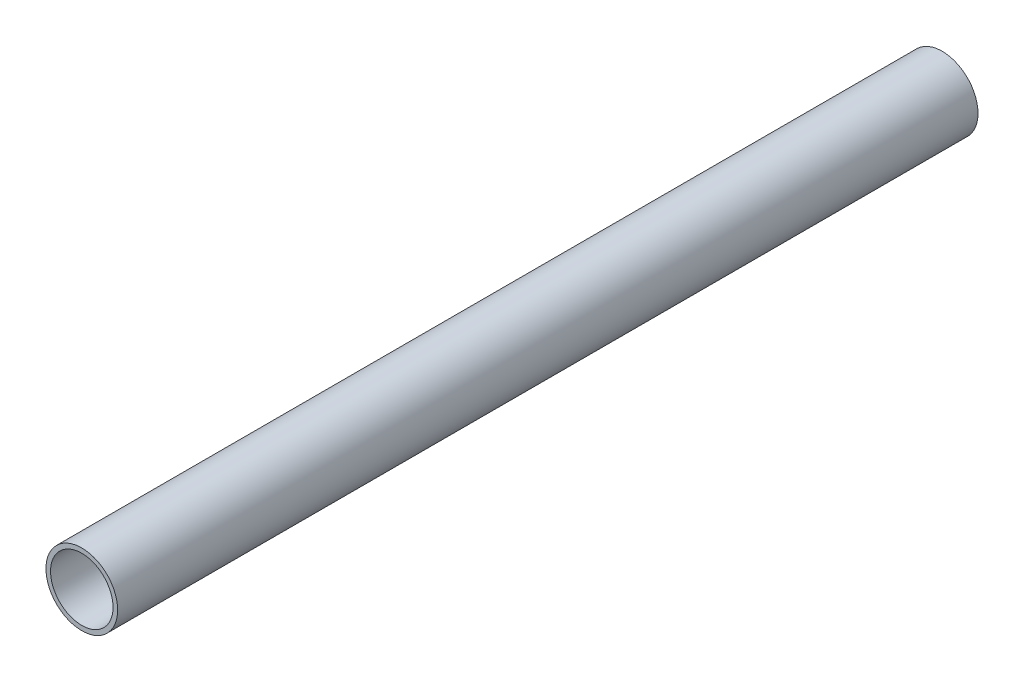
ISO-10303-21;
HEADER;
FILE_DESCRIPTION(('STEP AP214'),'2;1');
FILE_NAME('part.step','',(''),(''),'','','');
FILE_SCHEMA(('AUTOMOTIVE_DESIGN { 1 0 10303 214 1 1 1 1 }'));
ENDSEC;
DATA;
#1=APPLICATION_CONTEXT('core data for automotive mechanical design processes');
#2=APPLICATION_PROTOCOL_DEFINITION('international standard','automotive_design',2000,#1);
#3=PRODUCT_CONTEXT('',#1,'mechanical');
#4=PRODUCT('Part','Part','',(#3));
#5=PRODUCT_RELATED_PRODUCT_CATEGORY('part','',(#4));
#6=PRODUCT_DEFINITION_FORMATION('','',#4);
#7=PRODUCT_DEFINITION_CONTEXT('part definition',#1,'design');
#8=PRODUCT_DEFINITION('design','',#6,#7);
#9=PRODUCT_DEFINITION_SHAPE('','',#8);
#10=(LENGTH_UNIT() NAMED_UNIT(*) SI_UNIT(.MILLI.,.METRE.));
#11=(NAMED_UNIT(*) PLANE_ANGLE_UNIT() SI_UNIT($,.RADIAN.));
#12=(NAMED_UNIT(*) SI_UNIT($,.STERADIAN.) SOLID_ANGLE_UNIT());
#13=UNCERTAINTY_MEASURE_WITH_UNIT(LENGTH_MEASURE(1.E-05),#10,'distance_accuracy_value','');
#14=(GEOMETRIC_REPRESENTATION_CONTEXT(3) GLOBAL_UNCERTAINTY_ASSIGNED_CONTEXT((#13)) GLOBAL_UNIT_ASSIGNED_CONTEXT((#10,
#11,#12)) REPRESENTATION_CONTEXT('',''));
#15=CARTESIAN_POINT('',(0.,0.,0.));
#16=DIRECTION('',(0.,0.,1.));
#17=DIRECTION('',(1.,0.,0.));
#18=AXIS2_PLACEMENT_3D('',#15,#16,#17);
#19=CARTESIAN_POINT('',(0.,0.,76.2));
#20=DIRECTION('',(0.,0.,1.));
#21=DIRECTION('',(1.,0.,0.));
#22=AXIS2_PLACEMENT_3D('',#19,#20,#21);
#23=PLANE('',#22);
#24=CARTESIAN_POINT('',(0.,0.,76.2));
#25=DIRECTION('',(0.,0.,1.));
#26=DIRECTION('',(1.,0.,0.));
#27=AXIS2_PLACEMENT_3D('',#24,#25,#26);
#28=CIRCLE('',#27,6.35);
#29=CARTESIAN_POINT('',(6.35,0.,76.2));
#30=VERTEX_POINT('',#29);
#31=EDGE_CURVE('E10',#30,#30,#28,.T.);
#32=ORIENTED_EDGE('',*,*,#31,.T.);
#33=EDGE_LOOP('',(#32));
#34=FACE_BOUND('',#33,.T.);
#35=CARTESIAN_POINT('',(0.,0.,76.2));
#36=DIRECTION('',(0.,0.,1.));
#37=DIRECTION('',(1.,0.,0.));
#38=AXIS2_PLACEMENT_3D('',#35,#36,#37);
#39=CIRCLE('',#38,5.5372);
#40=CARTESIAN_POINT('',(5.5372,0.,76.2));
#41=VERTEX_POINT('',#40);
#42=EDGE_CURVE('E42',#41,#41,#39,.T.);
#43=ORIENTED_EDGE('',*,*,#42,.F.);
#44=EDGE_LOOP('',(#43));
#45=FACE_BOUND('',#44,.T.);
#46=ADVANCED_FACE('F31',(#34,#45),#23,.T.);
#47=CARTESIAN_POINT('',(0.,0.,-76.2));
#48=DIRECTION('',(0.,0.,1.));
#49=DIRECTION('',(1.,0.,0.));
#50=AXIS2_PLACEMENT_3D('',#47,#48,#49);
#51=PLANE('',#50);
#52=CARTESIAN_POINT('',(0.,0.,-76.2));
#53=DIRECTION('',(0.,0.,1.));
#54=DIRECTION('',(1.,0.,0.));
#55=AXIS2_PLACEMENT_3D('',#52,#53,#54);
#56=CIRCLE('',#55,6.35);
#57=CARTESIAN_POINT('',(6.35,0.,-76.2));
#58=VERTEX_POINT('',#57);
#59=EDGE_CURVE('E35',#58,#58,#56,.T.);
#60=ORIENTED_EDGE('',*,*,#59,.F.);
#61=EDGE_LOOP('',(#60));
#62=FACE_BOUND('',#61,.T.);
#63=CARTESIAN_POINT('',(0.,0.,-76.2));
#64=DIRECTION('',(0.,0.,1.));
#65=DIRECTION('',(1.,0.,0.));
#66=AXIS2_PLACEMENT_3D('',#63,#64,#65);
#67=CIRCLE('',#66,5.5372);
#68=CARTESIAN_POINT('',(5.5372,0.,-76.2));
#69=VERTEX_POINT('',#68);
#70=EDGE_CURVE('E44',#69,#69,#67,.T.);
#71=ORIENTED_EDGE('',*,*,#70,.T.);
#72=EDGE_LOOP('',(#71));
#73=FACE_BOUND('',#72,.T.);
#74=ADVANCED_FACE('F54',(#62,#73),#51,.F.);
#75=CARTESIAN_POINT('',(0.,0.,76.2));
#76=DIRECTION('',(0.,0.,-1.));
#77=DIRECTION('',(-1.,0.,0.));
#78=AXIS2_PLACEMENT_3D('',#75,#76,#77);
#79=CYLINDRICAL_SURFACE('',#78,6.35);
#80=ORIENTED_EDGE('',*,*,#31,.F.);
#81=EDGE_LOOP('',(#80));
#82=FACE_BOUND('',#81,.T.);
#83=ORIENTED_EDGE('',*,*,#59,.T.);
#84=EDGE_LOOP('',(#83));
#85=FACE_BOUND('',#84,.T.);
#86=ADVANCED_FACE('F33',(#82,#85),#79,.T.);
#87=CARTESIAN_POINT('',(0.,0.,76.2));
#88=DIRECTION('',(0.,0.,-1.));
#89=DIRECTION('',(-1.,0.,0.));
#90=AXIS2_PLACEMENT_3D('',#87,#88,#89);
#91=CYLINDRICAL_SURFACE('',#90,5.5372);
#92=ORIENTED_EDGE('',*,*,#42,.T.);
#93=EDGE_LOOP('',(#92));
#94=FACE_BOUND('',#93,.T.);
#95=ORIENTED_EDGE('',*,*,#70,.F.);
#96=EDGE_LOOP('',(#95));
#97=FACE_BOUND('',#96,.T.);
#98=ADVANCED_FACE('F50',(#94,#97),#91,.F.);
#99=CLOSED_SHELL('',(#46,#74,#86,#98));
#100=MANIFOLD_SOLID_BREP('B2',#99);
#101=ADVANCED_BREP_SHAPE_REPRESENTATION('',(#18,#100),#14);
#102=SHAPE_DEFINITION_REPRESENTATION(#9,#101);
ENDSEC;
END-ISO-10303-21;
